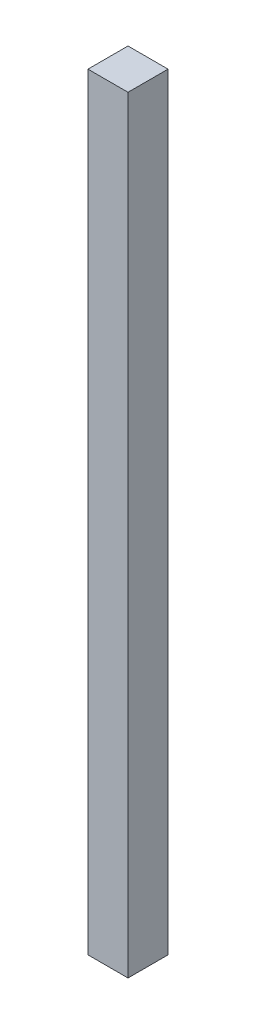
ISO-10303-21;
HEADER;
FILE_DESCRIPTION(('STEP AP214'),'2;1');
FILE_NAME('part.step','',(''),(''),'','','');
FILE_SCHEMA(('AUTOMOTIVE_DESIGN { 1 0 10303 214 1 1 1 1 }'));
ENDSEC;
DATA;
#1=APPLICATION_CONTEXT('core data for automotive mechanical design processes');
#2=APPLICATION_PROTOCOL_DEFINITION('international standard','automotive_design',2000,#1);
#3=PRODUCT_CONTEXT('',#1,'mechanical');
#4=PRODUCT('Part','Part','',(#3));
#5=PRODUCT_RELATED_PRODUCT_CATEGORY('part','',(#4));
#6=PRODUCT_DEFINITION_FORMATION('','',#4);
#7=PRODUCT_DEFINITION_CONTEXT('part definition',#1,'design');
#8=PRODUCT_DEFINITION('design','',#6,#7);
#9=PRODUCT_DEFINITION_SHAPE('','',#8);
#10=(LENGTH_UNIT() NAMED_UNIT(*) SI_UNIT(.MILLI.,.METRE.));
#11=(NAMED_UNIT(*) PLANE_ANGLE_UNIT() SI_UNIT($,.RADIAN.));
#12=(NAMED_UNIT(*) SI_UNIT($,.STERADIAN.) SOLID_ANGLE_UNIT());
#13=UNCERTAINTY_MEASURE_WITH_UNIT(LENGTH_MEASURE(1.E-05),#10,'distance_accuracy_value','');
#14=(GEOMETRIC_REPRESENTATION_CONTEXT(3) GLOBAL_UNCERTAINTY_ASSIGNED_CONTEXT((#13)) GLOBAL_UNIT_ASSIGNED_CONTEXT((#10,
#11,#12)) REPRESENTATION_CONTEXT('',''));
#15=CARTESIAN_POINT('',(0.,0.,0.));
#16=DIRECTION('',(0.,0.,1.));
#17=DIRECTION('',(1.,0.,0.));
#18=AXIS2_PLACEMENT_3D('',#15,#16,#17);
#19=CARTESIAN_POINT('',(4.44089209850063E-13,486.410000000003,0.));
#20=DIRECTION('',(1.,0.,0.));
#21=DIRECTION('',(0.,0.,-0.999999999999997));
#22=AXIS2_PLACEMENT_3D('',#19,#20,#21);
#23=PLANE('',#22);
#24=DIRECTION('',(0.,0.,0.999999999999997));
#25=VECTOR('',#24,1.);
#26=CARTESIAN_POINT('',(0.,0.,0.));
#27=LINE('',#26,#25);
#28=CARTESIAN_POINT('',(0.,0.,-25.4000000000001));
#29=VERTEX_POINT('',#28);
#30=CARTESIAN_POINT('',(0.,0.,0.));
#31=VERTEX_POINT('',#30);
#32=EDGE_CURVE('E97',#29,#31,#27,.T.);
#33=ORIENTED_EDGE('',*,*,#32,.T.);
#34=DIRECTION('',(0.,-1.,0.));
#35=VECTOR('',#34,1.);
#36=CARTESIAN_POINT('',(4.44089209850063E-13,486.410000000003,0.));
#37=LINE('',#36,#35);
#38=CARTESIAN_POINT('',(4.44089209850063E-13,486.410000000003,0.));
#39=VERTEX_POINT('',#38);
#40=EDGE_CURVE('E11',#39,#31,#37,.T.);
#41=ORIENTED_EDGE('',*,*,#40,.F.);
#42=DIRECTION('',(0.,0.,0.999999999999997));
#43=VECTOR('',#42,1.);
#44=CARTESIAN_POINT('',(4.44089209850063E-13,486.410000000003,0.));
#45=LINE('',#44,#43);
#46=CARTESIAN_POINT('',(4.44089209850063E-13,486.410000000003,-25.4000000000001));
#47=VERTEX_POINT('',#46);
#48=EDGE_CURVE('E85',#47,#39,#45,.T.);
#49=ORIENTED_EDGE('',*,*,#48,.F.);
#50=DIRECTION('',(0.,-1.,0.));
#51=VECTOR('',#50,1.);
#52=CARTESIAN_POINT('',(4.44089209850063E-13,486.410000000003,-25.4000000000001));
#53=LINE('',#52,#51);
#54=EDGE_CURVE('E93',#47,#29,#53,.T.);
#55=ORIENTED_EDGE('',*,*,#54,.T.);
#56=EDGE_LOOP('',(#33,#41,#49,#55));
#57=FACE_BOUND('',#56,.T.);
#58=ADVANCED_FACE('F34',(#57),#23,.F.);
#59=CARTESIAN_POINT('',(4.44089209850063E-13,486.410000000003,0.));
#60=DIRECTION('',(0.,0.,-0.999999999999997));
#61=DIRECTION('',(-1.,0.,0.));
#62=AXIS2_PLACEMENT_3D('',#59,#60,#61);
#63=PLANE('',#62);
#64=DIRECTION('',(1.,0.,0.));
#65=VECTOR('',#64,1.);
#66=CARTESIAN_POINT('',(0.,0.,0.));
#67=LINE('',#66,#65);
#68=CARTESIAN_POINT('',(25.4000000000001,-1.11022302462516E-13,0.));
#69=VERTEX_POINT('',#68);
#70=EDGE_CURVE('E89',#31,#69,#67,.T.);
#71=ORIENTED_EDGE('',*,*,#70,.T.);
#72=DIRECTION('',(0.,-1.,0.));
#73=VECTOR('',#72,1.);
#74=CARTESIAN_POINT('',(25.4000000000014,486.410000000002,0.));
#75=LINE('',#74,#73);
#76=CARTESIAN_POINT('',(25.4000000000014,486.410000000002,0.));
#77=VERTEX_POINT('',#76);
#78=EDGE_CURVE('E42',#77,#69,#75,.T.);
#79=ORIENTED_EDGE('',*,*,#78,.F.);
#80=DIRECTION('',(1.,0.,0.));
#81=VECTOR('',#80,1.);
#82=CARTESIAN_POINT('',(4.44089209850063E-13,486.410000000003,0.));
#83=LINE('',#82,#81);
#84=EDGE_CURVE('E80',#39,#77,#83,.T.);
#85=ORIENTED_EDGE('',*,*,#84,.F.);
#86=ORIENTED_EDGE('',*,*,#40,.T.);
#87=EDGE_LOOP('',(#71,#79,#85,#86));
#88=FACE_BOUND('',#87,.T.);
#89=ADVANCED_FACE('F88',(#88),#63,.F.);
#90=CARTESIAN_POINT('',(25.4000000000014,486.410000000002,0.));
#91=DIRECTION('',(-1.,0.,0.));
#92=DIRECTION('',(0.,0.,0.999999999999997));
#93=AXIS2_PLACEMENT_3D('',#90,#91,#92);
#94=PLANE('',#93);
#95=DIRECTION('',(0.,0.,-0.999999999999997));
#96=VECTOR('',#95,1.);
#97=CARTESIAN_POINT('',(25.4000000000001,-1.11022302462516E-13,0.));
#98=LINE('',#97,#96);
#99=CARTESIAN_POINT('',(25.4000000000001,-1.11022302462516E-13,-25.4000000000001));
#100=VERTEX_POINT('',#99);
#101=EDGE_CURVE('E67',#69,#100,#98,.T.);
#102=ORIENTED_EDGE('',*,*,#101,.T.);
#103=DIRECTION('',(0.,-1.,0.));
#104=VECTOR('',#103,1.);
#105=CARTESIAN_POINT('',(25.4000000000014,486.410000000002,-25.4000000000001));
#106=LINE('',#105,#104);
#107=CARTESIAN_POINT('',(25.4000000000014,486.410000000002,-25.4000000000001));
#108=VERTEX_POINT('',#107);
#109=EDGE_CURVE('E90',#108,#100,#106,.T.);
#110=ORIENTED_EDGE('',*,*,#109,.F.);
#111=DIRECTION('',(0.,0.,-0.999999999999997));
#112=VECTOR('',#111,1.);
#113=CARTESIAN_POINT('',(25.4000000000014,486.410000000002,0.));
#114=LINE('',#113,#112);
#115=EDGE_CURVE('E83',#77,#108,#114,.T.);
#116=ORIENTED_EDGE('',*,*,#115,.F.);
#117=ORIENTED_EDGE('',*,*,#78,.T.);
#118=EDGE_LOOP('',(#102,#110,#116,#117));
#119=FACE_BOUND('',#118,.T.);
#120=ADVANCED_FACE('F91',(#119),#94,.F.);
#121=CARTESIAN_POINT('',(4.44089209850063E-13,486.410000000003,-25.4000000000001));
#122=DIRECTION('',(0.,0.,0.999999999999997));
#123=DIRECTION('',(1.,0.,0.));
#124=AXIS2_PLACEMENT_3D('',#121,#122,#123);
#125=PLANE('',#124);
#126=DIRECTION('',(-1.,0.,0.));
#127=VECTOR('',#126,1.);
#128=CARTESIAN_POINT('',(0.,0.,-25.4000000000001));
#129=LINE('',#128,#127);
#130=EDGE_CURVE('E73',#100,#29,#129,.T.);
#131=ORIENTED_EDGE('',*,*,#130,.T.);
#132=ORIENTED_EDGE('',*,*,#54,.F.);
#133=DIRECTION('',(-1.,0.,0.));
#134=VECTOR('',#133,1.);
#135=CARTESIAN_POINT('',(4.44089209850063E-13,486.410000000003,-25.4000000000001));
#136=LINE('',#135,#134);
#137=EDGE_CURVE('E50',#108,#47,#136,.T.);
#138=ORIENTED_EDGE('',*,*,#137,.F.);
#139=ORIENTED_EDGE('',*,*,#109,.T.);
#140=EDGE_LOOP('',(#131,#132,#138,#139));
#141=FACE_BOUND('',#140,.T.);
#142=ADVANCED_FACE('F104',(#141),#125,.F.);
#143=CARTESIAN_POINT('',(4.44089209850063E-13,486.410000000003,0.));
#144=DIRECTION('',(0.,-1.,0.));
#145=DIRECTION('',(0.,0.,-0.999999999999997));
#146=AXIS2_PLACEMENT_3D('',#143,#144,#145);
#147=PLANE('',#146);
#148=ORIENTED_EDGE('',*,*,#48,.T.);
#149=ORIENTED_EDGE('',*,*,#84,.T.);
#150=ORIENTED_EDGE('',*,*,#115,.T.);
#151=ORIENTED_EDGE('',*,*,#137,.T.);
#152=EDGE_LOOP('',(#148,#149,#150,#151));
#153=FACE_BOUND('',#152,.T.);
#154=ADVANCED_FACE('F81',(#153),#147,.F.);
#155=CARTESIAN_POINT('',(0.,0.,0.));
#156=DIRECTION('',(0.,-1.,0.));
#157=DIRECTION('',(0.,0.,-0.999999999999997));
#158=AXIS2_PLACEMENT_3D('',#155,#156,#157);
#159=PLANE('',#158);
#160=ORIENTED_EDGE('',*,*,#32,.F.);
#161=ORIENTED_EDGE('',*,*,#130,.F.);
#162=ORIENTED_EDGE('',*,*,#101,.F.);
#163=ORIENTED_EDGE('',*,*,#70,.F.);
#164=EDGE_LOOP('',(#160,#161,#162,#163));
#165=FACE_BOUND('',#164,.T.);
#166=ADVANCED_FACE('F107',(#165),#159,.T.);
#167=CLOSED_SHELL('',(#58,#89,#120,#142,#154,#166));
#168=MANIFOLD_SOLID_BREP('B2',#167);
#169=ADVANCED_BREP_SHAPE_REPRESENTATION('',(#18,#168),#14);
#170=SHAPE_DEFINITION_REPRESENTATION(#9,#169);
ENDSEC;
END-ISO-10303-21;
